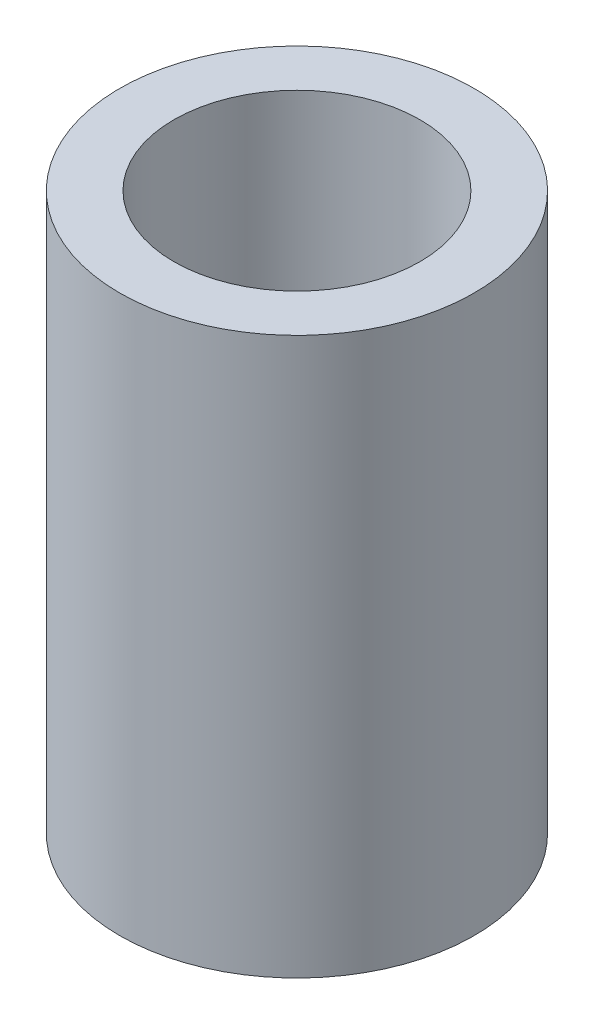
ISO-10303-21;
HEADER;
FILE_DESCRIPTION(('STEP AP214'),'2;1');
FILE_NAME('part.step','',(''),(''),'','','');
FILE_SCHEMA(('AUTOMOTIVE_DESIGN { 1 0 10303 214 1 1 1 1 }'));
ENDSEC;
DATA;
#1=APPLICATION_CONTEXT('core data for automotive mechanical design processes');
#2=APPLICATION_PROTOCOL_DEFINITION('international standard','automotive_design',2000,#1);
#3=PRODUCT_CONTEXT('',#1,'mechanical');
#4=PRODUCT('Part','Part','',(#3));
#5=PRODUCT_RELATED_PRODUCT_CATEGORY('part','',(#4));
#6=PRODUCT_DEFINITION_FORMATION('','',#4);
#7=PRODUCT_DEFINITION_CONTEXT('part definition',#1,'design');
#8=PRODUCT_DEFINITION('design','',#6,#7);
#9=PRODUCT_DEFINITION_SHAPE('','',#8);
#10=(LENGTH_UNIT() NAMED_UNIT(*) SI_UNIT(.MILLI.,.METRE.));
#11=(NAMED_UNIT(*) PLANE_ANGLE_UNIT() SI_UNIT($,.RADIAN.));
#12=(NAMED_UNIT(*) SI_UNIT($,.STERADIAN.) SOLID_ANGLE_UNIT());
#13=UNCERTAINTY_MEASURE_WITH_UNIT(LENGTH_MEASURE(1.E-05),#10,'distance_accuracy_value','');
#14=(GEOMETRIC_REPRESENTATION_CONTEXT(3) GLOBAL_UNCERTAINTY_ASSIGNED_CONTEXT((#13)) GLOBAL_UNIT_ASSIGNED_CONTEXT((#10,
#11,#12)) REPRESENTATION_CONTEXT('',''));
#15=CARTESIAN_POINT('',(0.,0.,0.));
#16=DIRECTION('',(0.,0.,1.));
#17=DIRECTION('',(1.,0.,0.));
#18=AXIS2_PLACEMENT_3D('',#15,#16,#17);
#19=CARTESIAN_POINT('',(0.,9.5,0.));
#20=DIRECTION('',(0.,1.,0.));
#21=DIRECTION('',(0.,0.,1.));
#22=AXIS2_PLACEMENT_3D('',#19,#20,#21);
#23=PLANE('',#22);
#24=CARTESIAN_POINT('',(0.,9.5,0.));
#25=DIRECTION('',(0.,1.,0.));
#26=DIRECTION('',(0.,0.,1.));
#27=AXIS2_PLACEMENT_3D('',#24,#25,#26);
#28=CIRCLE('',#27,3.025);
#29=CARTESIAN_POINT('',(0.,9.5,3.025));
#30=VERTEX_POINT('',#29);
#31=EDGE_CURVE('E10',#30,#30,#28,.T.);
#32=ORIENTED_EDGE('',*,*,#31,.T.);
#33=EDGE_LOOP('',(#32));
#34=FACE_BOUND('',#33,.T.);
#35=CARTESIAN_POINT('',(0.,9.5,0.));
#36=DIRECTION('',(0.,1.,0.));
#37=DIRECTION('',(0.,0.,1.));
#38=AXIS2_PLACEMENT_3D('',#35,#36,#37);
#39=CIRCLE('',#38,2.1);
#40=CARTESIAN_POINT('',(0.,9.5,2.1));
#41=VERTEX_POINT('',#40);
#42=EDGE_CURVE('E42',#41,#41,#39,.T.);
#43=ORIENTED_EDGE('',*,*,#42,.F.);
#44=EDGE_LOOP('',(#43));
#45=FACE_BOUND('',#44,.T.);
#46=ADVANCED_FACE('F31',(#34,#45),#23,.T.);
#47=CARTESIAN_POINT('',(0.,0.,0.));
#48=DIRECTION('',(0.,1.,0.));
#49=DIRECTION('',(0.,0.,1.));
#50=AXIS2_PLACEMENT_3D('',#47,#48,#49);
#51=PLANE('',#50);
#52=CARTESIAN_POINT('',(0.,0.,0.));
#53=DIRECTION('',(0.,1.,0.));
#54=DIRECTION('',(0.,0.,1.));
#55=AXIS2_PLACEMENT_3D('',#52,#53,#54);
#56=CIRCLE('',#55,3.025);
#57=CARTESIAN_POINT('',(0.,0.,3.025));
#58=VERTEX_POINT('',#57);
#59=EDGE_CURVE('E35',#58,#58,#56,.T.);
#60=ORIENTED_EDGE('',*,*,#59,.F.);
#61=EDGE_LOOP('',(#60));
#62=FACE_BOUND('',#61,.T.);
#63=CARTESIAN_POINT('',(0.,0.,0.));
#64=DIRECTION('',(0.,1.,0.));
#65=DIRECTION('',(0.,0.,1.));
#66=AXIS2_PLACEMENT_3D('',#63,#64,#65);
#67=CIRCLE('',#66,2.1);
#68=CARTESIAN_POINT('',(0.,0.,2.1));
#69=VERTEX_POINT('',#68);
#70=EDGE_CURVE('E44',#69,#69,#67,.T.);
#71=ORIENTED_EDGE('',*,*,#70,.T.);
#72=EDGE_LOOP('',(#71));
#73=FACE_BOUND('',#72,.T.);
#74=ADVANCED_FACE('F54',(#62,#73),#51,.F.);
#75=CARTESIAN_POINT('',(0.,9.5,0.));
#76=DIRECTION('',(0.,-1.,0.));
#77=DIRECTION('',(0.,0.,-1.));
#78=AXIS2_PLACEMENT_3D('',#75,#76,#77);
#79=CYLINDRICAL_SURFACE('',#78,3.025);
#80=ORIENTED_EDGE('',*,*,#31,.F.);
#81=EDGE_LOOP('',(#80));
#82=FACE_BOUND('',#81,.T.);
#83=ORIENTED_EDGE('',*,*,#59,.T.);
#84=EDGE_LOOP('',(#83));
#85=FACE_BOUND('',#84,.T.);
#86=ADVANCED_FACE('F33',(#82,#85),#79,.T.);
#87=CARTESIAN_POINT('',(0.,9.5,0.));
#88=DIRECTION('',(0.,-1.,0.));
#89=DIRECTION('',(0.,0.,-1.));
#90=AXIS2_PLACEMENT_3D('',#87,#88,#89);
#91=CYLINDRICAL_SURFACE('',#90,2.1);
#92=ORIENTED_EDGE('',*,*,#42,.T.);
#93=EDGE_LOOP('',(#92));
#94=FACE_BOUND('',#93,.T.);
#95=ORIENTED_EDGE('',*,*,#70,.F.);
#96=EDGE_LOOP('',(#95));
#97=FACE_BOUND('',#96,.T.);
#98=ADVANCED_FACE('F50',(#94,#97),#91,.F.);
#99=CLOSED_SHELL('',(#46,#74,#86,#98));
#100=MANIFOLD_SOLID_BREP('B2',#99);
#101=ADVANCED_BREP_SHAPE_REPRESENTATION('',(#18,#100),#14);
#102=SHAPE_DEFINITION_REPRESENTATION(#9,#101);
ENDSEC;
END-ISO-10303-21;
